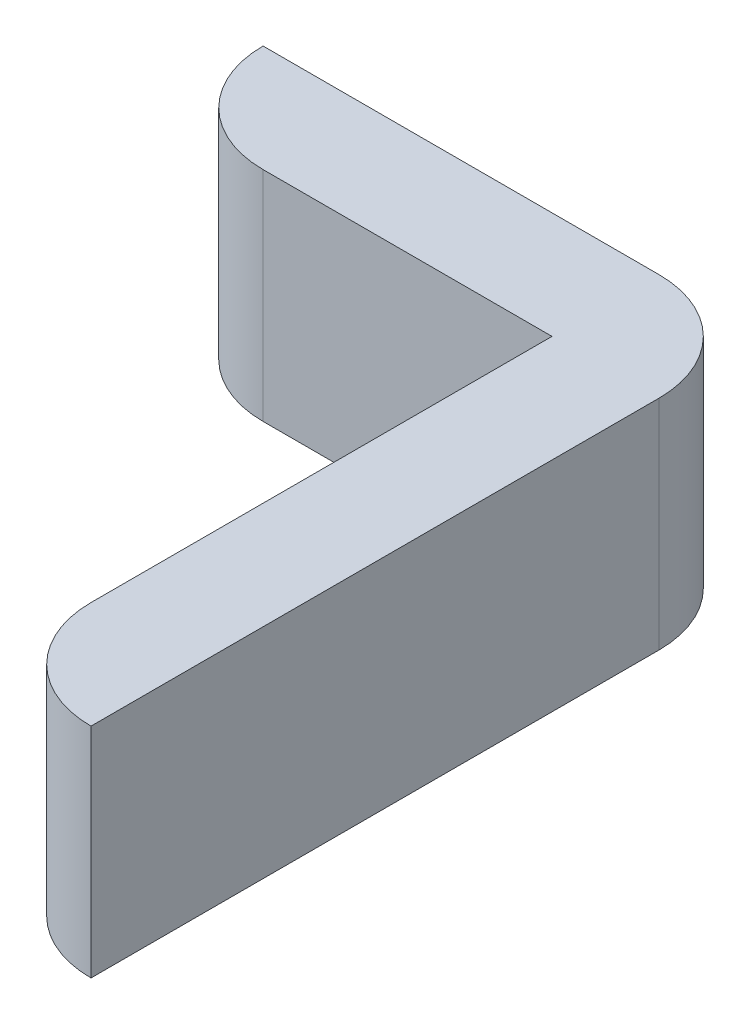
ISO-10303-21;
HEADER;
FILE_DESCRIPTION(('STEP AP214'),'2;1');
FILE_NAME('part.step','',(''),(''),'','','');
FILE_SCHEMA(('AUTOMOTIVE_DESIGN { 1 0 10303 214 1 1 1 1 }'));
ENDSEC;
DATA;
#1=APPLICATION_CONTEXT('core data for automotive mechanical design processes');
#2=APPLICATION_PROTOCOL_DEFINITION('international standard','automotive_design',2000,#1);
#3=PRODUCT_CONTEXT('',#1,'mechanical');
#4=PRODUCT('Part','Part','',(#3));
#5=PRODUCT_RELATED_PRODUCT_CATEGORY('part','',(#4));
#6=PRODUCT_DEFINITION_FORMATION('','',#4);
#7=PRODUCT_DEFINITION_CONTEXT('part definition',#1,'design');
#8=PRODUCT_DEFINITION('design','',#6,#7);
#9=PRODUCT_DEFINITION_SHAPE('','',#8);
#10=(LENGTH_UNIT() NAMED_UNIT(*) SI_UNIT(.MILLI.,.METRE.));
#11=(NAMED_UNIT(*) PLANE_ANGLE_UNIT() SI_UNIT($,.RADIAN.));
#12=(NAMED_UNIT(*) SI_UNIT($,.STERADIAN.) SOLID_ANGLE_UNIT());
#13=UNCERTAINTY_MEASURE_WITH_UNIT(LENGTH_MEASURE(1.E-05),#10,'distance_accuracy_value','');
#14=(GEOMETRIC_REPRESENTATION_CONTEXT(3) GLOBAL_UNCERTAINTY_ASSIGNED_CONTEXT((#13)) GLOBAL_UNIT_ASSIGNED_CONTEXT((#10,
#11,#12)) REPRESENTATION_CONTEXT('',''));
#15=CARTESIAN_POINT('',(0.,0.,0.));
#16=DIRECTION('',(0.,0.,1.));
#17=DIRECTION('',(1.,0.,0.));
#18=AXIS2_PLACEMENT_3D('',#15,#16,#17);
#19=CARTESIAN_POINT('',(9.275,-8.6352,0.));
#20=DIRECTION('',(0.,-1.,0.));
#21=DIRECTION('',(0.,0.,-1.));
#22=AXIS2_PLACEMENT_3D('',#19,#20,#21);
#23=PLANE('',#22);
#24=DIRECTION('',(-1.,0.,0.));
#25=VECTOR('',#24,1.);
#26=CARTESIAN_POINT('',(9.525,-8.6352,0.25));
#27=LINE('',#26,#25);
#28=CARTESIAN_POINT('',(9.525,-8.6352,0.25));
#29=VERTEX_POINT('',#28);
#30=CARTESIAN_POINT('',(10.2,-8.6352,0.25));
#31=VERTEX_POINT('',#30);
#32=EDGE_CURVE('E102',#29,#31,#27,.F.);
#33=ORIENTED_EDGE('',*,*,#32,.T.);
#34=DIRECTION('',(0.,0.,-1.));
#35=VECTOR('',#34,1.);
#36=CARTESIAN_POINT('',(10.2,-8.6352,0.25));
#37=LINE('',#36,#35);
#38=CARTESIAN_POINT('',(10.2,-8.6352,1.327));
#39=VERTEX_POINT('',#38);
#40=EDGE_CURVE('E108',#31,#39,#37,.F.);
#41=ORIENTED_EDGE('',*,*,#40,.T.);
#42=CARTESIAN_POINT('',(10.45,-8.6352,1.327));
#43=DIRECTION('',(0.,-1.,0.));
#44=DIRECTION('',(0.,0.,-1.));
#45=AXIS2_PLACEMENT_3D('',#42,#43,#44);
#46=CIRCLE('',#45,0.25);
#47=CARTESIAN_POINT('',(10.45,-8.6352,1.577));
#48=VERTEX_POINT('',#47);
#49=EDGE_CURVE('E80',#48,#39,#46,.T.);
#50=ORIENTED_EDGE('',*,*,#49,.F.);
#51=DIRECTION('',(0.,0.,1.));
#52=VECTOR('',#51,1.);
#53=CARTESIAN_POINT('',(10.45,-8.6352,1.577));
#54=LINE('',#53,#52);
#55=CARTESIAN_POINT('',(10.45,-8.6352,0.25));
#56=VERTEX_POINT('',#55);
#57=EDGE_CURVE('E75',#48,#56,#54,.F.);
#58=ORIENTED_EDGE('',*,*,#57,.T.);
#59=CARTESIAN_POINT('',(10.2,-8.6352,0.25));
#60=DIRECTION('',(0.,-1.,0.));
#61=DIRECTION('',(0.,0.,-1.));
#62=AXIS2_PLACEMENT_3D('',#59,#60,#61);
#63=CIRCLE('',#62,0.25);
#64=CARTESIAN_POINT('',(10.2,-8.6352,0.));
#65=VERTEX_POINT('',#64);
#66=EDGE_CURVE('E19',#65,#56,#63,.T.);
#67=ORIENTED_EDGE('',*,*,#66,.F.);
#68=DIRECTION('',(1.,0.,0.));
#69=VECTOR('',#68,1.);
#70=CARTESIAN_POINT('',(10.2,-8.6352,0.));
#71=LINE('',#70,#69);
#72=CARTESIAN_POINT('',(9.275,-8.6352,0.));
#73=VERTEX_POINT('',#72);
#74=EDGE_CURVE('E70',#65,#73,#71,.F.);
#75=ORIENTED_EDGE('',*,*,#74,.T.);
#76=CARTESIAN_POINT('',(9.525,-8.6352,0.));
#77=DIRECTION('',(0.,-1.,0.));
#78=DIRECTION('',(0.,0.,-1.));
#79=AXIS2_PLACEMENT_3D('',#76,#77,#78);
#80=CIRCLE('',#79,0.25);
#81=EDGE_CURVE('E121',#29,#73,#80,.T.);
#82=ORIENTED_EDGE('',*,*,#81,.F.);
#83=EDGE_LOOP('',(#33,#41,#50,#58,#67,#75,#82));
#84=FACE_BOUND('',#83,.T.);
#85=ADVANCED_FACE('F16',(#84),#23,.F.);
#86=CARTESIAN_POINT('',(10.2,-9.1448,0.));
#87=DIRECTION('',(0.,0.,1.));
#88=DIRECTION('',(1.,0.,0.));
#89=AXIS2_PLACEMENT_3D('',#86,#87,#88);
#90=PLANE('',#89);
#91=DIRECTION('',(0.,-1.,0.));
#92=VECTOR('',#91,1.);
#93=CARTESIAN_POINT('',(9.275,-9.1448,0.));
#94=LINE('',#93,#92);
#95=CARTESIAN_POINT('',(9.275,-9.1448,0.));
#96=VERTEX_POINT('',#95);
#97=EDGE_CURVE('E123',#73,#96,#94,.T.);
#98=ORIENTED_EDGE('',*,*,#97,.F.);
#99=ORIENTED_EDGE('',*,*,#74,.F.);
#100=DIRECTION('',(0.,-1.,0.));
#101=VECTOR('',#100,1.);
#102=CARTESIAN_POINT('',(10.2,-9.1448,0.));
#103=LINE('',#102,#101);
#104=CARTESIAN_POINT('',(10.2,-9.1448,0.));
#105=VERTEX_POINT('',#104);
#106=EDGE_CURVE('E92',#105,#65,#103,.F.);
#107=ORIENTED_EDGE('',*,*,#106,.F.);
#108=DIRECTION('',(1.,0.,0.));
#109=VECTOR('',#108,1.);
#110=CARTESIAN_POINT('',(9.275,-9.1448,0.));
#111=LINE('',#110,#109);
#112=EDGE_CURVE('E120',#96,#105,#111,.T.);
#113=ORIENTED_EDGE('',*,*,#112,.F.);
#114=EDGE_LOOP('',(#98,#99,#107,#113));
#115=FACE_BOUND('',#114,.T.);
#116=ADVANCED_FACE('F158',(#115),#90,.F.);
#117=CARTESIAN_POINT('',(10.2,-9.1448,0.25));
#118=DIRECTION('',(0.,-1.,0.));
#119=DIRECTION('',(0.,0.,-1.));
#120=AXIS2_PLACEMENT_3D('',#117,#118,#119);
#121=CYLINDRICAL_SURFACE('',#120,0.25);
#122=ORIENTED_EDGE('',*,*,#66,.T.);
#123=DIRECTION('',(0.,1.,0.));
#124=VECTOR('',#123,1.);
#125=CARTESIAN_POINT('',(10.45,-9.1448,0.25));
#126=LINE('',#125,#124);
#127=CARTESIAN_POINT('',(10.45,-9.1448,0.25));
#128=VERTEX_POINT('',#127);
#129=EDGE_CURVE('E86',#56,#128,#126,.F.);
#130=ORIENTED_EDGE('',*,*,#129,.T.);
#131=CARTESIAN_POINT('',(10.2,-9.1448,0.25));
#132=DIRECTION('',(0.,-1.,0.));
#133=DIRECTION('',(0.,0.,-1.));
#134=AXIS2_PLACEMENT_3D('',#131,#132,#133);
#135=CIRCLE('',#134,0.25);
#136=EDGE_CURVE('E118',#105,#128,#135,.T.);
#137=ORIENTED_EDGE('',*,*,#136,.F.);
#138=ORIENTED_EDGE('',*,*,#106,.T.);
#139=EDGE_LOOP('',(#122,#130,#137,#138));
#140=FACE_BOUND('',#139,.T.);
#141=ADVANCED_FACE('F89',(#140),#121,.T.);
#142=CARTESIAN_POINT('',(10.45,-9.1448,1.577));
#143=DIRECTION('',(-1.,0.,0.));
#144=DIRECTION('',(0.,0.,1.));
#145=AXIS2_PLACEMENT_3D('',#142,#143,#144);
#146=PLANE('',#145);
#147=DIRECTION('',(0.,-1.,0.));
#148=VECTOR('',#147,1.);
#149=CARTESIAN_POINT('',(10.45,-9.1448,1.577));
#150=LINE('',#149,#148);
#151=CARTESIAN_POINT('',(10.45,-9.1448,1.577));
#152=VERTEX_POINT('',#151);
#153=EDGE_CURVE('E85',#152,#48,#150,.F.);
#154=ORIENTED_EDGE('',*,*,#153,.F.);
#155=DIRECTION('',(0.,0.,-1.));
#156=VECTOR('',#155,1.);
#157=CARTESIAN_POINT('',(10.45,-9.1448,0.));
#158=LINE('',#157,#156);
#159=EDGE_CURVE('E94',#128,#152,#158,.F.);
#160=ORIENTED_EDGE('',*,*,#159,.F.);
#161=ORIENTED_EDGE('',*,*,#129,.F.);
#162=ORIENTED_EDGE('',*,*,#57,.F.);
#163=EDGE_LOOP('',(#154,#160,#161,#162));
#164=FACE_BOUND('',#163,.T.);
#165=ADVANCED_FACE('F93',(#164),#146,.F.);
#166=CARTESIAN_POINT('',(10.45,-9.1448,1.327));
#167=DIRECTION('',(0.,-1.,0.));
#168=DIRECTION('',(0.,0.,-1.));
#169=AXIS2_PLACEMENT_3D('',#166,#167,#168);
#170=CYLINDRICAL_SURFACE('',#169,0.25);
#171=ORIENTED_EDGE('',*,*,#49,.T.);
#172=DIRECTION('',(0.,1.,0.));
#173=VECTOR('',#172,1.);
#174=CARTESIAN_POINT('',(10.2,-9.1448,1.327));
#175=LINE('',#174,#173);
#176=CARTESIAN_POINT('',(10.2,-9.1448,1.327));
#177=VERTEX_POINT('',#176);
#178=EDGE_CURVE('E105',#39,#177,#175,.F.);
#179=ORIENTED_EDGE('',*,*,#178,.T.);
#180=CARTESIAN_POINT('',(10.45,-9.1448,1.327));
#181=DIRECTION('',(0.,-1.,0.));
#182=DIRECTION('',(0.,0.,-1.));
#183=AXIS2_PLACEMENT_3D('',#180,#181,#182);
#184=CIRCLE('',#183,0.25);
#185=EDGE_CURVE('E114',#152,#177,#184,.T.);
#186=ORIENTED_EDGE('',*,*,#185,.F.);
#187=ORIENTED_EDGE('',*,*,#153,.T.);
#188=EDGE_LOOP('',(#171,#179,#186,#187));
#189=FACE_BOUND('',#188,.T.);
#190=ADVANCED_FACE('F127',(#189),#170,.T.);
#191=CARTESIAN_POINT('',(10.2,-9.1448,0.25));
#192=DIRECTION('',(1.,0.,0.));
#193=DIRECTION('',(0.,0.,-1.));
#194=AXIS2_PLACEMENT_3D('',#191,#192,#193);
#195=PLANE('',#194);
#196=ORIENTED_EDGE('',*,*,#178,.F.);
#197=ORIENTED_EDGE('',*,*,#40,.F.);
#198=DIRECTION('',(0.,1.,0.));
#199=VECTOR('',#198,1.);
#200=CARTESIAN_POINT('',(10.2,-9.1448,0.25));
#201=LINE('',#200,#199);
#202=CARTESIAN_POINT('',(10.2,-9.1448,0.25));
#203=VERTEX_POINT('',#202);
#204=EDGE_CURVE('E104',#31,#203,#201,.F.);
#205=ORIENTED_EDGE('',*,*,#204,.T.);
#206=DIRECTION('',(0.,0.,-1.));
#207=VECTOR('',#206,1.);
#208=CARTESIAN_POINT('',(10.2,-9.1448,0.));
#209=LINE('',#208,#207);
#210=EDGE_CURVE('E117',#177,#203,#209,.T.);
#211=ORIENTED_EDGE('',*,*,#210,.F.);
#212=EDGE_LOOP('',(#196,#197,#205,#211));
#213=FACE_BOUND('',#212,.T.);
#214=ADVANCED_FACE('F150',(#213),#195,.F.);
#215=CARTESIAN_POINT('',(9.525,-9.1448,0.25));
#216=DIRECTION('',(0.,0.,-1.));
#217=DIRECTION('',(-1.,0.,0.));
#218=AXIS2_PLACEMENT_3D('',#215,#216,#217);
#219=PLANE('',#218);
#220=ORIENTED_EDGE('',*,*,#204,.F.);
#221=ORIENTED_EDGE('',*,*,#32,.F.);
#222=DIRECTION('',(0.,-1.,0.));
#223=VECTOR('',#222,1.);
#224=CARTESIAN_POINT('',(9.525,-9.1448,0.25));
#225=LINE('',#224,#223);
#226=CARTESIAN_POINT('',(9.525,-9.1448,0.25));
#227=VERTEX_POINT('',#226);
#228=EDGE_CURVE('E34',#227,#29,#225,.F.);
#229=ORIENTED_EDGE('',*,*,#228,.F.);
#230=DIRECTION('',(1.,0.,0.));
#231=VECTOR('',#230,1.);
#232=CARTESIAN_POINT('',(9.275,-9.1448,0.25));
#233=LINE('',#232,#231);
#234=EDGE_CURVE('E25',#203,#227,#233,.F.);
#235=ORIENTED_EDGE('',*,*,#234,.F.);
#236=EDGE_LOOP('',(#220,#221,#229,#235));
#237=FACE_BOUND('',#236,.T.);
#238=ADVANCED_FACE('F151',(#237),#219,.F.);
#239=CARTESIAN_POINT('',(9.525,-9.1448,0.));
#240=DIRECTION('',(0.,-1.,0.));
#241=DIRECTION('',(0.,0.,-1.));
#242=AXIS2_PLACEMENT_3D('',#239,#240,#241);
#243=CYLINDRICAL_SURFACE('',#242,0.25);
#244=ORIENTED_EDGE('',*,*,#81,.T.);
#245=ORIENTED_EDGE('',*,*,#97,.T.);
#246=CARTESIAN_POINT('',(9.525,-9.1448,0.));
#247=DIRECTION('',(0.,-1.,0.));
#248=DIRECTION('',(0.,0.,-1.));
#249=AXIS2_PLACEMENT_3D('',#246,#247,#248);
#250=CIRCLE('',#249,0.25);
#251=EDGE_CURVE('E11',#227,#96,#250,.T.);
#252=ORIENTED_EDGE('',*,*,#251,.F.);
#253=ORIENTED_EDGE('',*,*,#228,.T.);
#254=EDGE_LOOP('',(#244,#245,#252,#253));
#255=FACE_BOUND('',#254,.T.);
#256=ADVANCED_FACE('F156',(#255),#243,.T.);
#257=CARTESIAN_POINT('',(9.275,-9.1448,0.));
#258=DIRECTION('',(0.,-1.,0.));
#259=DIRECTION('',(0.,0.,-1.));
#260=AXIS2_PLACEMENT_3D('',#257,#258,#259);
#261=PLANE('',#260);
#262=ORIENTED_EDGE('',*,*,#234,.T.);
#263=ORIENTED_EDGE('',*,*,#251,.T.);
#264=ORIENTED_EDGE('',*,*,#112,.T.);
#265=ORIENTED_EDGE('',*,*,#136,.T.);
#266=ORIENTED_EDGE('',*,*,#159,.T.);
#267=ORIENTED_EDGE('',*,*,#185,.T.);
#268=ORIENTED_EDGE('',*,*,#210,.T.);
#269=EDGE_LOOP('',(#262,#263,#264,#265,#266,#267,#268));
#270=FACE_BOUND('',#269,.T.);
#271=ADVANCED_FACE('F132',(#270),#261,.T.);
#272=CLOSED_SHELL('',(#85,#116,#141,#165,#190,#214,#238,#256,#271));
#273=MANIFOLD_SOLID_BREP('B1',#272);
#274=ADVANCED_BREP_SHAPE_REPRESENTATION('',(#18,#273),#14);
#275=SHAPE_DEFINITION_REPRESENTATION(#9,#274);
ENDSEC;
END-ISO-10303-21;
